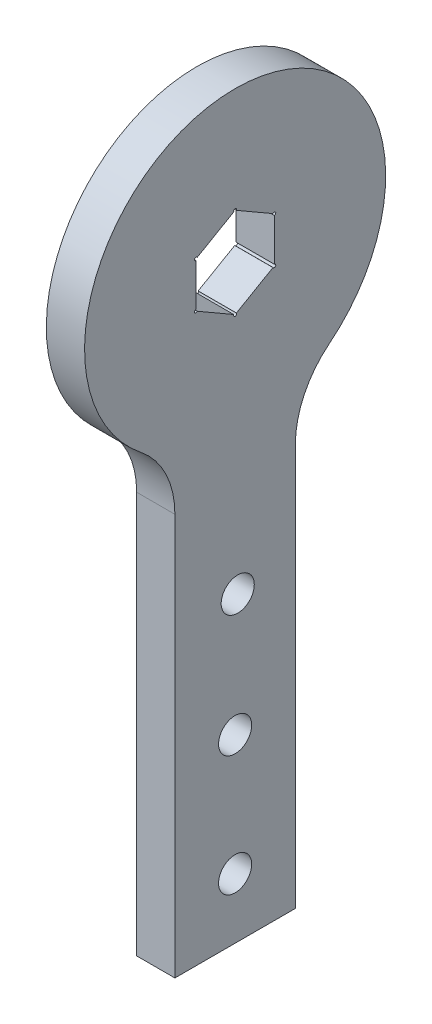
ISO-10303-21;
HEADER;
FILE_DESCRIPTION(('STEP AP214'),'2;1');
FILE_NAME('part.step','',(''),(''),'','','');
FILE_SCHEMA(('AUTOMOTIVE_DESIGN { 1 0 10303 214 1 1 1 1 }'));
ENDSEC;
DATA;
#1=APPLICATION_CONTEXT('core data for automotive mechanical design processes');
#2=APPLICATION_PROTOCOL_DEFINITION('international standard','automotive_design',2000,#1);
#3=PRODUCT_CONTEXT('',#1,'mechanical');
#4=PRODUCT('Part','Part','',(#3));
#5=PRODUCT_RELATED_PRODUCT_CATEGORY('part','',(#4));
#6=PRODUCT_DEFINITION_FORMATION('','',#4);
#7=PRODUCT_DEFINITION_CONTEXT('part definition',#1,'design');
#8=PRODUCT_DEFINITION('design','',#6,#7);
#9=PRODUCT_DEFINITION_SHAPE('','',#8);
#10=(LENGTH_UNIT() NAMED_UNIT(*) SI_UNIT(.MILLI.,.METRE.));
#11=(NAMED_UNIT(*) PLANE_ANGLE_UNIT() SI_UNIT($,.RADIAN.));
#12=(NAMED_UNIT(*) SI_UNIT($,.STERADIAN.) SOLID_ANGLE_UNIT());
#13=UNCERTAINTY_MEASURE_WITH_UNIT(LENGTH_MEASURE(1.E-05),#10,'distance_accuracy_value','');
#14=(GEOMETRIC_REPRESENTATION_CONTEXT(3) GLOBAL_UNCERTAINTY_ASSIGNED_CONTEXT((#13)) GLOBAL_UNIT_ASSIGNED_CONTEXT((#10,
#11,#12)) REPRESENTATION_CONTEXT('',''));
#15=CARTESIAN_POINT('',(0.,0.,0.));
#16=DIRECTION('',(0.,0.,1.));
#17=DIRECTION('',(1.,0.,0.));
#18=AXIS2_PLACEMENT_3D('',#15,#16,#17);
#19=CARTESIAN_POINT('',(6.35,-97.9128784747792,10.));
#20=DIRECTION('',(0.,1.,0.));
#21=DIRECTION('',(0.,0.,1.));
#22=AXIS2_PLACEMENT_3D('',#19,#20,#21);
#23=PLANE('',#22);
#24=DIRECTION('',(0.,0.,-1.));
#25=VECTOR('',#24,1.);
#26=CARTESIAN_POINT('',(0.,-97.9128784747792,10.));
#27=LINE('',#26,#25);
#28=CARTESIAN_POINT('',(0.,-97.9128784747792,10.));
#29=VERTEX_POINT('',#28);
#30=CARTESIAN_POINT('',(0.,-97.9128784747792,-10.));
#31=VERTEX_POINT('',#30);
#32=EDGE_CURVE('E205',#29,#31,#27,.T.);
#33=ORIENTED_EDGE('',*,*,#32,.T.);
#34=DIRECTION('',(-1.,0.,0.));
#35=VECTOR('',#34,1.);
#36=CARTESIAN_POINT('',(6.35,-97.9128784747792,-10.));
#37=LINE('',#36,#35);
#38=CARTESIAN_POINT('',(6.35,-97.9128784747792,-10.));
#39=VERTEX_POINT('',#38);
#40=EDGE_CURVE('E244',#39,#31,#37,.T.);
#41=ORIENTED_EDGE('',*,*,#40,.F.);
#42=DIRECTION('',(0.,0.,-1.));
#43=VECTOR('',#42,1.);
#44=CARTESIAN_POINT('',(6.35,-97.9128784747792,10.));
#45=LINE('',#44,#43);
#46=CARTESIAN_POINT('',(6.35,-97.9128784747792,10.));
#47=VERTEX_POINT('',#46);
#48=EDGE_CURVE('E220',#47,#39,#45,.T.);
#49=ORIENTED_EDGE('',*,*,#48,.F.);
#50=DIRECTION('',(-1.,0.,0.));
#51=VECTOR('',#50,1.);
#52=CARTESIAN_POINT('',(6.35,-97.9128784747792,10.));
#53=LINE('',#52,#51);
#54=EDGE_CURVE('E232',#47,#29,#53,.T.);
#55=ORIENTED_EDGE('',*,*,#54,.T.);
#56=EDGE_LOOP('',(#33,#41,#49,#55));
#57=FACE_BOUND('',#56,.T.);
#58=ADVANCED_FACE('F40',(#57),#23,.F.);
#59=CARTESIAN_POINT('',(6.35,-97.9128784747792,-10.));
#60=DIRECTION('',(0.,0.,1.));
#61=DIRECTION('',(0.,-1.,0.));
#62=AXIS2_PLACEMENT_3D('',#59,#60,#61);
#63=PLANE('',#62);
#64=DIRECTION('',(0.,1.,0.));
#65=VECTOR('',#64,1.);
#66=CARTESIAN_POINT('',(0.,-97.9128784747792,-10.));
#67=LINE('',#66,#65);
#68=CARTESIAN_POINT('',(0.,-31.224989991992,-10.));
#69=VERTEX_POINT('',#68);
#70=EDGE_CURVE('E235',#31,#69,#67,.T.);
#71=ORIENTED_EDGE('',*,*,#70,.T.);
#72=DIRECTION('',(1.,0.,0.));
#73=VECTOR('',#72,1.);
#74=CARTESIAN_POINT('',(6.35,-31.224989991992,-10.));
#75=LINE('',#74,#73);
#76=CARTESIAN_POINT('',(6.35,-31.224989991992,-10.));
#77=VERTEX_POINT('',#76);
#78=EDGE_CURVE('E252',#69,#77,#75,.T.);
#79=ORIENTED_EDGE('',*,*,#78,.T.);
#80=DIRECTION('',(0.,1.,0.));
#81=VECTOR('',#80,1.);
#82=CARTESIAN_POINT('',(6.35,-97.9128784747792,-10.));
#83=LINE('',#82,#81);
#84=EDGE_CURVE('E223',#39,#77,#83,.T.);
#85=ORIENTED_EDGE('',*,*,#84,.F.);
#86=ORIENTED_EDGE('',*,*,#40,.T.);
#87=EDGE_LOOP('',(#71,#79,#85,#86));
#88=FACE_BOUND('',#87,.T.);
#89=ADVANCED_FACE('F286',(#88),#63,.F.);
#90=CARTESIAN_POINT('',(6.35,0.,0.));
#91=DIRECTION('',(-1.,0.,0.));
#92=DIRECTION('',(0.,0.,1.));
#93=AXIS2_PLACEMENT_3D('',#90,#91,#92);
#94=CYLINDRICAL_SURFACE('',#93,25.);
#95=CARTESIAN_POINT('',(6.35,0.,0.));
#96=DIRECTION('',(1.,0.,0.));
#97=DIRECTION('',(0.,0.,-1.));
#98=AXIS2_PLACEMENT_3D('',#95,#96,#97);
#99=CIRCLE('',#98,25.);
#100=CARTESIAN_POINT('',(6.35,-19.515618744995,-15.625));
#101=VERTEX_POINT('',#100);
#102=CARTESIAN_POINT('',(6.35,-19.515618744995,15.625));
#103=VERTEX_POINT('',#102);
#104=EDGE_CURVE('E227',#101,#103,#99,.T.);
#105=ORIENTED_EDGE('',*,*,#104,.F.);
#106=DIRECTION('',(-1.,0.,0.));
#107=VECTOR('',#106,1.);
#108=CARTESIAN_POINT('',(6.35,-19.515618744995,-15.625));
#109=LINE('',#108,#107);
#110=CARTESIAN_POINT('',(0.,-19.515618744995,-15.625));
#111=VERTEX_POINT('',#110);
#112=EDGE_CURVE('E249',#101,#111,#109,.T.);
#113=ORIENTED_EDGE('',*,*,#112,.T.);
#114=CARTESIAN_POINT('',(0.,0.,0.));
#115=DIRECTION('',(1.,0.,0.));
#116=DIRECTION('',(0.,0.,-1.));
#117=AXIS2_PLACEMENT_3D('',#114,#115,#116);
#118=CIRCLE('',#117,25.);
#119=CARTESIAN_POINT('',(0.,-19.515618744995,15.625));
#120=VERTEX_POINT('',#119);
#121=EDGE_CURVE('E238',#111,#120,#118,.T.);
#122=ORIENTED_EDGE('',*,*,#121,.T.);
#123=DIRECTION('',(-1.,0.,0.));
#124=VECTOR('',#123,1.);
#125=CARTESIAN_POINT('',(6.35,-19.515618744995,15.625));
#126=LINE('',#125,#124);
#127=EDGE_CURVE('E247',#120,#103,#126,.F.);
#128=ORIENTED_EDGE('',*,*,#127,.T.);
#129=EDGE_LOOP('',(#105,#113,#122,#128));
#130=FACE_BOUND('',#129,.T.);
#131=ADVANCED_FACE('F270',(#130),#94,.T.);
#132=CARTESIAN_POINT('',(6.35,-22.9128784747792,10.));
#133=DIRECTION('',(0.,0.,-1.));
#134=DIRECTION('',(0.,1.,0.));
#135=AXIS2_PLACEMENT_3D('',#132,#133,#134);
#136=PLANE('',#135);
#137=DIRECTION('',(0.,-1.,0.));
#138=VECTOR('',#137,1.);
#139=CARTESIAN_POINT('',(6.35,-22.9128784747792,10.));
#140=LINE('',#139,#138);
#141=CARTESIAN_POINT('',(6.35,-31.224989991992,10.));
#142=VERTEX_POINT('',#141);
#143=EDGE_CURVE('E230',#142,#47,#140,.T.);
#144=ORIENTED_EDGE('',*,*,#143,.F.);
#145=DIRECTION('',(1.,0.,0.));
#146=VECTOR('',#145,1.);
#147=CARTESIAN_POINT('',(0.,-31.224989991992,10.));
#148=LINE('',#147,#146);
#149=CARTESIAN_POINT('',(0.,-31.224989991992,10.));
#150=VERTEX_POINT('',#149);
#151=EDGE_CURVE('E254',#142,#150,#148,.F.);
#152=ORIENTED_EDGE('',*,*,#151,.T.);
#153=DIRECTION('',(0.,-1.,0.));
#154=VECTOR('',#153,1.);
#155=CARTESIAN_POINT('',(0.,-22.9128784747792,10.));
#156=LINE('',#155,#154);
#157=EDGE_CURVE('E224',#150,#29,#156,.T.);
#158=ORIENTED_EDGE('',*,*,#157,.T.);
#159=ORIENTED_EDGE('',*,*,#54,.F.);
#160=EDGE_LOOP('',(#144,#152,#158,#159));
#161=FACE_BOUND('',#160,.T.);
#162=ADVANCED_FACE('F277',(#161),#136,.F.);
#163=CARTESIAN_POINT('',(6.35,0.,0.));
#164=DIRECTION('',(1.,0.,0.));
#165=DIRECTION('',(0.,0.,-1.));
#166=AXIS2_PLACEMENT_3D('',#163,#164,#165);
#167=PLANE('',#166);
#168=CARTESIAN_POINT('',(6.35,7.50555349946514,0.));
#169=DIRECTION('',(1.,0.,0.));
#170=DIRECTION('',(0.,0.,-1.));
#171=AXIS2_PLACEMENT_3D('',#168,#169,#170);
#172=CIRCLE('',#171,0.25);
#173=CARTESIAN_POINT('',(6.35,7.38055349946514,-0.21650635094611));
#174=VERTEX_POINT('',#173);
#175=CARTESIAN_POINT('',(6.35,7.38055349946514,0.21650635094611));
#176=VERTEX_POINT('',#175);
#177=EDGE_CURVE('E163',#174,#176,#172,.T.);
#178=ORIENTED_EDGE('',*,*,#177,.F.);
#179=DIRECTION('',(0.,0.5,0.866025403784439));
#180=VECTOR('',#179,1.);
#181=CARTESIAN_POINT('',(6.35,3.75277674973257,-6.5));
#182=LINE('',#181,#180);
#183=CARTESIAN_POINT('',(6.35,3.87777674973256,-6.28349364905391));
#184=VERTEX_POINT('',#183);
#185=EDGE_CURVE('E190',#184,#174,#182,.T.);
#186=ORIENTED_EDGE('',*,*,#185,.F.);
#187=CARTESIAN_POINT('',(6.35,3.75277674973255,-6.50000000000001));
#188=DIRECTION('',(1.,0.,0.));
#189=DIRECTION('',(0.,0.,-1.));
#190=AXIS2_PLACEMENT_3D('',#187,#188,#189);
#191=CIRCLE('',#190,0.25);
#192=CARTESIAN_POINT('',(6.35,3.50277674973255,-6.5));
#193=VERTEX_POINT('',#192);
#194=EDGE_CURVE('E525',#193,#184,#191,.T.);
#195=ORIENTED_EDGE('',*,*,#194,.F.);
#196=DIRECTION('',(0.,1.,0.));
#197=VECTOR('',#196,1.);
#198=CARTESIAN_POINT('',(6.35,-3.75277674973257,-6.5));
#199=LINE('',#198,#197);
#200=CARTESIAN_POINT('',(6.35,-3.5027767497326,-6.5));
#201=VERTEX_POINT('',#200);
#202=EDGE_CURVE('E195',#201,#193,#199,.T.);
#203=ORIENTED_EDGE('',*,*,#202,.F.);
#204=CARTESIAN_POINT('',(6.35,-3.7527767497326,-6.49999999999998));
#205=DIRECTION('',(1.,0.,0.));
#206=DIRECTION('',(0.,0.,-1.));
#207=AXIS2_PLACEMENT_3D('',#204,#205,#206);
#208=CIRCLE('',#207,0.25);
#209=CARTESIAN_POINT('',(6.35,-3.87777674973258,-6.28349364905386));
#210=VERTEX_POINT('',#209);
#211=EDGE_CURVE('E524',#210,#201,#208,.T.);
#212=ORIENTED_EDGE('',*,*,#211,.F.);
#213=DIRECTION('',(0.,0.5,-0.866025403784438));
#214=VECTOR('',#213,1.);
#215=CARTESIAN_POINT('',(6.35,-7.50555349946514,0.));
#216=LINE('',#215,#214);
#217=CARTESIAN_POINT('',(6.35,-7.38055349946511,-0.216506350946143));
#218=VERTEX_POINT('',#217);
#219=EDGE_CURVE('E507',#218,#210,#216,.T.);
#220=ORIENTED_EDGE('',*,*,#219,.F.);
#221=CARTESIAN_POINT('',(6.35,-7.50555349946514,0.));
#222=DIRECTION('',(1.,0.,0.));
#223=DIRECTION('',(0.,0.,-1.));
#224=AXIS2_PLACEMENT_3D('',#221,#222,#223);
#225=CIRCLE('',#224,0.25);
#226=CARTESIAN_POINT('',(6.35,-7.38055349946511,0.216506350946149));
#227=VERTEX_POINT('',#226);
#228=EDGE_CURVE('E544',#227,#218,#225,.T.);
#229=ORIENTED_EDGE('',*,*,#228,.F.);
#230=DIRECTION('',(0.,-0.5,-0.866025403784438));
#231=VECTOR('',#230,1.);
#232=CARTESIAN_POINT('',(6.35,-3.75277674973257,6.5));
#233=LINE('',#232,#231);
#234=CARTESIAN_POINT('',(6.35,-3.87777674973254,6.28349364905394));
#235=VERTEX_POINT('',#234);
#236=EDGE_CURVE('E505',#235,#227,#233,.T.);
#237=ORIENTED_EDGE('',*,*,#236,.F.);
#238=CARTESIAN_POINT('',(6.35,-3.75277674973251,6.50000000000004));
#239=DIRECTION('',(1.,0.,0.));
#240=DIRECTION('',(0.,0.,-1.));
#241=AXIS2_PLACEMENT_3D('',#238,#239,#240);
#242=CIRCLE('',#241,0.25);
#243=CARTESIAN_POINT('',(6.35,-3.50277674973251,6.5));
#244=VERTEX_POINT('',#243);
#245=EDGE_CURVE('E487',#244,#235,#242,.T.);
#246=ORIENTED_EDGE('',*,*,#245,.F.);
#247=DIRECTION('',(0.,-1.,0.));
#248=VECTOR('',#247,1.);
#249=CARTESIAN_POINT('',(6.35,3.75277674973257,6.5));
#250=LINE('',#249,#248);
#251=CARTESIAN_POINT('',(6.35,3.50277674973264,6.5));
#252=VERTEX_POINT('',#251);
#253=EDGE_CURVE('E189',#252,#244,#250,.T.);
#254=ORIENTED_EDGE('',*,*,#253,.F.);
#255=CARTESIAN_POINT('',(6.35,3.75277674973264,6.49999999999996));
#256=DIRECTION('',(1.,0.,0.));
#257=DIRECTION('',(0.,0.,-1.));
#258=AXIS2_PLACEMENT_3D('',#255,#256,#257);
#259=CIRCLE('',#258,0.25);
#260=CARTESIAN_POINT('',(6.35,3.87777674973261,6.28349364905383));
#261=VERTEX_POINT('',#260);
#262=EDGE_CURVE('E188',#261,#252,#259,.T.);
#263=ORIENTED_EDGE('',*,*,#262,.F.);
#264=DIRECTION('',(0.,-0.5,0.866025403784439));
#265=VECTOR('',#264,1.);
#266=CARTESIAN_POINT('',(6.35,7.50555349946514,0.));
#267=LINE('',#266,#265);
#268=EDGE_CURVE('E180',#176,#261,#267,.T.);
#269=ORIENTED_EDGE('',*,*,#268,.F.);
#270=EDGE_LOOP('',(#178,#186,#195,#203,#212,#220,#229,#237,#246,#254,#263,#269));
#271=FACE_BOUND('',#270,.T.);
#272=CARTESIAN_POINT('',(6.35,-87.9128784747792,0.));
#273=DIRECTION('',(1.,0.,0.));
#274=DIRECTION('',(0.,0.,-1.));
#275=AXIS2_PLACEMENT_3D('',#272,#273,#274);
#276=CIRCLE('',#275,2.75);
#277=CARTESIAN_POINT('',(6.35,-87.9128784747792,-2.75));
#278=VERTEX_POINT('',#277);
#279=EDGE_CURVE('E206',#278,#278,#276,.T.);
#280=ORIENTED_EDGE('',*,*,#279,.F.);
#281=EDGE_LOOP('',(#280));
#282=FACE_BOUND('',#281,.T.);
#283=CARTESIAN_POINT('',(6.35,-67.9128784747792,0.));
#284=DIRECTION('',(1.,0.,0.));
#285=DIRECTION('',(0.,0.,-1.));
#286=AXIS2_PLACEMENT_3D('',#283,#284,#285);
#287=CIRCLE('',#286,2.75);
#288=CARTESIAN_POINT('',(6.35,-67.9128784747792,-2.75));
#289=VERTEX_POINT('',#288);
#290=EDGE_CURVE('E209',#289,#289,#287,.T.);
#291=ORIENTED_EDGE('',*,*,#290,.F.);
#292=EDGE_LOOP('',(#291));
#293=FACE_BOUND('',#292,.T.);
#294=CARTESIAN_POINT('',(6.35,-47.9128784747792,-0.431184647680993));
#295=DIRECTION('',(1.,0.,0.));
#296=DIRECTION('',(0.,0.,-1.));
#297=AXIS2_PLACEMENT_3D('',#294,#295,#296);
#298=CIRCLE('',#297,2.75);
#299=CARTESIAN_POINT('',(6.35,-47.9128784747792,-3.18118464768099));
#300=VERTEX_POINT('',#299);
#301=EDGE_CURVE('E215',#300,#300,#298,.T.);
#302=ORIENTED_EDGE('',*,*,#301,.F.);
#303=EDGE_LOOP('',(#302));
#304=FACE_BOUND('',#303,.T.);
#305=ORIENTED_EDGE('',*,*,#48,.T.);
#306=ORIENTED_EDGE('',*,*,#84,.T.);
#307=CARTESIAN_POINT('',(6.35,-31.224989991992,-25.));
#308=DIRECTION('',(1.,0.,0.));
#309=DIRECTION('',(0.,0.,-1.));
#310=AXIS2_PLACEMENT_3D('',#307,#308,#309);
#311=CIRCLE('',#310,15.);
#312=EDGE_CURVE('E259',#77,#101,#311,.F.);
#313=ORIENTED_EDGE('',*,*,#312,.T.);
#314=ORIENTED_EDGE('',*,*,#104,.T.);
#315=CARTESIAN_POINT('',(6.35,-31.224989991992,25.));
#316=DIRECTION('',(1.,0.,0.));
#317=DIRECTION('',(0.,0.,-1.));
#318=AXIS2_PLACEMENT_3D('',#315,#316,#317);
#319=CIRCLE('',#318,15.);
#320=EDGE_CURVE('E11',#103,#142,#319,.F.);
#321=ORIENTED_EDGE('',*,*,#320,.T.);
#322=ORIENTED_EDGE('',*,*,#143,.T.);
#323=EDGE_LOOP('',(#305,#306,#313,#314,#321,#322));
#324=FACE_BOUND('',#323,.T.);
#325=ADVANCED_FACE('F185',(#271,#282,#293,#304,#324),#167,.T.);
#326=CARTESIAN_POINT('',(0.,0.,0.));
#327=DIRECTION('',(1.,0.,0.));
#328=DIRECTION('',(0.,0.,-1.));
#329=AXIS2_PLACEMENT_3D('',#326,#327,#328);
#330=PLANE('',#329);
#331=DIRECTION('',(0.,-0.5,-0.866025403784439));
#332=VECTOR('',#331,1.);
#333=CARTESIAN_POINT('',(0.,3.75277674973257,-6.5));
#334=LINE('',#333,#332);
#335=CARTESIAN_POINT('',(0.,7.38055349946514,-0.216506350946111));
#336=VERTEX_POINT('',#335);
#337=CARTESIAN_POINT('',(0.,3.87777674973256,-6.28349364905391));
#338=VERTEX_POINT('',#337);
#339=EDGE_CURVE('E552',#336,#338,#334,.T.);
#340=ORIENTED_EDGE('',*,*,#339,.F.);
#341=CARTESIAN_POINT('',(0.,7.50555349946514,0.));
#342=DIRECTION('',(1.,0.,0.));
#343=DIRECTION('',(0.,0.,-1.));
#344=AXIS2_PLACEMENT_3D('',#341,#342,#343);
#345=CIRCLE('',#344,0.25);
#346=CARTESIAN_POINT('',(0.,7.38055349946514,0.21650635094611));
#347=VERTEX_POINT('',#346);
#348=EDGE_CURVE('E174',#347,#336,#345,.F.);
#349=ORIENTED_EDGE('',*,*,#348,.F.);
#350=DIRECTION('',(0.,0.5,-0.866025403784439));
#351=VECTOR('',#350,1.);
#352=CARTESIAN_POINT('',(0.,7.50555349946514,0.));
#353=LINE('',#352,#351);
#354=CARTESIAN_POINT('',(0.,3.87777674973261,6.28349364905383));
#355=VERTEX_POINT('',#354);
#356=EDGE_CURVE('E182',#355,#347,#353,.T.);
#357=ORIENTED_EDGE('',*,*,#356,.F.);
#358=CARTESIAN_POINT('',(0.,3.75277674973264,6.49999999999996));
#359=DIRECTION('',(1.,0.,0.));
#360=DIRECTION('',(0.,0.,-1.));
#361=AXIS2_PLACEMENT_3D('',#358,#359,#360);
#362=CIRCLE('',#361,0.25);
#363=CARTESIAN_POINT('',(0.,3.50277674973264,6.5));
#364=VERTEX_POINT('',#363);
#365=EDGE_CURVE('E63',#364,#355,#362,.F.);
#366=ORIENTED_EDGE('',*,*,#365,.F.);
#367=DIRECTION('',(0.,1.,0.));
#368=VECTOR('',#367,1.);
#369=CARTESIAN_POINT('',(0.,3.75277674973257,6.5));
#370=LINE('',#369,#368);
#371=CARTESIAN_POINT('',(0.,-3.50277674973251,6.5));
#372=VERTEX_POINT('',#371);
#373=EDGE_CURVE('E500',#372,#364,#370,.T.);
#374=ORIENTED_EDGE('',*,*,#373,.F.);
#375=CARTESIAN_POINT('',(0.,-3.75277674973251,6.50000000000004));
#376=DIRECTION('',(1.,0.,0.));
#377=DIRECTION('',(0.,0.,-1.));
#378=AXIS2_PLACEMENT_3D('',#375,#376,#377);
#379=CIRCLE('',#378,0.25);
#380=CARTESIAN_POINT('',(0.,-3.87777674973254,6.28349364905394));
#381=VERTEX_POINT('',#380);
#382=EDGE_CURVE('E55',#381,#372,#379,.F.);
#383=ORIENTED_EDGE('',*,*,#382,.F.);
#384=DIRECTION('',(0.,0.5,0.866025403784439));
#385=VECTOR('',#384,1.);
#386=CARTESIAN_POINT('',(0.,-3.75277674973257,6.5));
#387=LINE('',#386,#385);
#388=CARTESIAN_POINT('',(0.,-7.38055349946511,0.216506350946149));
#389=VERTEX_POINT('',#388);
#390=EDGE_CURVE('E498',#389,#381,#387,.T.);
#391=ORIENTED_EDGE('',*,*,#390,.F.);
#392=CARTESIAN_POINT('',(0.,-7.50555349946514,0.));
#393=DIRECTION('',(1.,0.,0.));
#394=DIRECTION('',(0.,0.,-1.));
#395=AXIS2_PLACEMENT_3D('',#392,#393,#394);
#396=CIRCLE('',#395,0.25);
#397=CARTESIAN_POINT('',(0.,-7.38055349946516,-0.216506350946069));
#398=VERTEX_POINT('',#397);
#399=EDGE_CURVE('E542',#398,#389,#396,.F.);
#400=ORIENTED_EDGE('',*,*,#399,.F.);
#401=DIRECTION('',(0.,-0.5,0.866025403784439));
#402=VECTOR('',#401,1.);
#403=CARTESIAN_POINT('',(0.,-7.50555349946514,0.));
#404=LINE('',#403,#402);
#405=CARTESIAN_POINT('',(0.,-3.87777674973258,-6.28349364905387));
#406=VERTEX_POINT('',#405);
#407=EDGE_CURVE('E193',#406,#398,#404,.T.);
#408=ORIENTED_EDGE('',*,*,#407,.F.);
#409=CARTESIAN_POINT('',(0.,-3.7527767497326,-6.49999999999998));
#410=DIRECTION('',(1.,0.,0.));
#411=DIRECTION('',(0.,0.,-1.));
#412=AXIS2_PLACEMENT_3D('',#409,#410,#411);
#413=CIRCLE('',#412,0.25);
#414=CARTESIAN_POINT('',(0.,-3.5027767497326,-6.5));
#415=VERTEX_POINT('',#414);
#416=EDGE_CURVE('E536',#415,#406,#413,.F.);
#417=ORIENTED_EDGE('',*,*,#416,.F.);
#418=DIRECTION('',(0.,-1.,0.));
#419=VECTOR('',#418,1.);
#420=CARTESIAN_POINT('',(0.,-3.75277674973257,-6.5));
#421=LINE('',#420,#419);
#422=CARTESIAN_POINT('',(0.,3.50277674973255,-6.5));
#423=VERTEX_POINT('',#422);
#424=EDGE_CURVE('E550',#423,#415,#421,.T.);
#425=ORIENTED_EDGE('',*,*,#424,.F.);
#426=CARTESIAN_POINT('',(0.,3.75277674973255,-6.50000000000001));
#427=DIRECTION('',(1.,0.,0.));
#428=DIRECTION('',(0.,0.,-1.));
#429=AXIS2_PLACEMENT_3D('',#426,#427,#428);
#430=CIRCLE('',#429,0.25);
#431=EDGE_CURVE('E528',#338,#423,#430,.F.);
#432=ORIENTED_EDGE('',*,*,#431,.F.);
#433=EDGE_LOOP('',(#340,#349,#357,#366,#374,#383,#391,#400,#408,#417,#425,#432));
#434=FACE_BOUND('',#433,.T.);
#435=CARTESIAN_POINT('',(0.,-87.9128784747792,0.));
#436=DIRECTION('',(1.,0.,0.));
#437=DIRECTION('',(0.,0.,-1.));
#438=AXIS2_PLACEMENT_3D('',#435,#436,#437);
#439=CIRCLE('',#438,2.75);
#440=CARTESIAN_POINT('',(0.,-87.9128784747792,-2.75));
#441=VERTEX_POINT('',#440);
#442=EDGE_CURVE('E202',#441,#441,#439,.T.);
#443=ORIENTED_EDGE('',*,*,#442,.T.);
#444=EDGE_LOOP('',(#443));
#445=FACE_BOUND('',#444,.T.);
#446=CARTESIAN_POINT('',(0.,-67.9128784747792,0.));
#447=DIRECTION('',(1.,0.,0.));
#448=DIRECTION('',(0.,0.,-1.));
#449=AXIS2_PLACEMENT_3D('',#446,#447,#448);
#450=CIRCLE('',#449,2.75);
#451=CARTESIAN_POINT('',(0.,-67.9128784747792,-2.75));
#452=VERTEX_POINT('',#451);
#453=EDGE_CURVE('E212',#452,#452,#450,.T.);
#454=ORIENTED_EDGE('',*,*,#453,.T.);
#455=EDGE_LOOP('',(#454));
#456=FACE_BOUND('',#455,.T.);
#457=CARTESIAN_POINT('',(0.,-47.9128784747792,-0.431184647680993));
#458=DIRECTION('',(1.,0.,0.));
#459=DIRECTION('',(0.,0.,-1.));
#460=AXIS2_PLACEMENT_3D('',#457,#458,#459);
#461=CIRCLE('',#460,2.75);
#462=CARTESIAN_POINT('',(0.,-47.9128784747792,-3.18118464768099));
#463=VERTEX_POINT('',#462);
#464=EDGE_CURVE('E201',#463,#463,#461,.T.);
#465=ORIENTED_EDGE('',*,*,#464,.T.);
#466=EDGE_LOOP('',(#465));
#467=FACE_BOUND('',#466,.T.);
#468=ORIENTED_EDGE('',*,*,#32,.F.);
#469=ORIENTED_EDGE('',*,*,#157,.F.);
#470=CARTESIAN_POINT('',(0.,-31.224989991992,25.));
#471=DIRECTION('',(1.,0.,0.));
#472=DIRECTION('',(0.,0.,-1.));
#473=AXIS2_PLACEMENT_3D('',#470,#471,#472);
#474=CIRCLE('',#473,15.);
#475=EDGE_CURVE('E48',#150,#120,#474,.T.);
#476=ORIENTED_EDGE('',*,*,#475,.T.);
#477=ORIENTED_EDGE('',*,*,#121,.F.);
#478=CARTESIAN_POINT('',(0.,-31.224989991992,-25.));
#479=DIRECTION('',(1.,0.,0.));
#480=DIRECTION('',(0.,0.,-1.));
#481=AXIS2_PLACEMENT_3D('',#478,#479,#480);
#482=CIRCLE('',#481,15.);
#483=EDGE_CURVE('E257',#111,#69,#482,.T.);
#484=ORIENTED_EDGE('',*,*,#483,.T.);
#485=ORIENTED_EDGE('',*,*,#70,.F.);
#486=EDGE_LOOP('',(#468,#469,#476,#477,#484,#485));
#487=FACE_BOUND('',#486,.T.);
#488=ADVANCED_FACE('F264',(#434,#445,#456,#467,#487),#330,.F.);
#489=CARTESIAN_POINT('',(0.,-47.9128784747792,-0.431184647680993));
#490=DIRECTION('',(1.,0.,0.));
#491=DIRECTION('',(0.,0.,-1.));
#492=AXIS2_PLACEMENT_3D('',#489,#490,#491);
#493=CYLINDRICAL_SURFACE('',#492,2.75);
#494=ORIENTED_EDGE('',*,*,#464,.F.);
#495=EDGE_LOOP('',(#494));
#496=FACE_BOUND('',#495,.T.);
#497=ORIENTED_EDGE('',*,*,#301,.T.);
#498=EDGE_LOOP('',(#497));
#499=FACE_BOUND('',#498,.T.);
#500=ADVANCED_FACE('F310',(#496,#499),#493,.F.);
#501=CARTESIAN_POINT('',(0.,-67.9128784747792,0.));
#502=DIRECTION('',(1.,0.,0.));
#503=DIRECTION('',(0.,0.,-1.));
#504=AXIS2_PLACEMENT_3D('',#501,#502,#503);
#505=CYLINDRICAL_SURFACE('',#504,2.75);
#506=ORIENTED_EDGE('',*,*,#453,.F.);
#507=EDGE_LOOP('',(#506));
#508=FACE_BOUND('',#507,.T.);
#509=ORIENTED_EDGE('',*,*,#290,.T.);
#510=EDGE_LOOP('',(#509));
#511=FACE_BOUND('',#510,.T.);
#512=ADVANCED_FACE('F304',(#508,#511),#505,.F.);
#513=CARTESIAN_POINT('',(0.,-87.9128784747792,0.));
#514=DIRECTION('',(1.,0.,0.));
#515=DIRECTION('',(0.,0.,-1.));
#516=AXIS2_PLACEMENT_3D('',#513,#514,#515);
#517=CYLINDRICAL_SURFACE('',#516,2.75);
#518=ORIENTED_EDGE('',*,*,#442,.F.);
#519=EDGE_LOOP('',(#518));
#520=FACE_BOUND('',#519,.T.);
#521=ORIENTED_EDGE('',*,*,#279,.T.);
#522=EDGE_LOOP('',(#521));
#523=FACE_BOUND('',#522,.T.);
#524=ADVANCED_FACE('F298',(#520,#523),#517,.F.);
#525=CARTESIAN_POINT('',(6.35,-31.224989991992,-25.));
#526=DIRECTION('',(-1.,0.,0.));
#527=DIRECTION('',(0.,0.,1.));
#528=AXIS2_PLACEMENT_3D('',#525,#526,#527);
#529=CYLINDRICAL_SURFACE('',#528,15.);
#530=ORIENTED_EDGE('',*,*,#312,.F.);
#531=ORIENTED_EDGE('',*,*,#78,.F.);
#532=ORIENTED_EDGE('',*,*,#483,.F.);
#533=ORIENTED_EDGE('',*,*,#112,.F.);
#534=EDGE_LOOP('',(#530,#531,#532,#533));
#535=FACE_BOUND('',#534,.T.);
#536=ADVANCED_FACE('F285',(#535),#529,.F.);
#537=CARTESIAN_POINT('',(6.35,-31.224989991992,25.));
#538=DIRECTION('',(-1.,0.,0.));
#539=DIRECTION('',(0.,0.,1.));
#540=AXIS2_PLACEMENT_3D('',#537,#538,#539);
#541=CYLINDRICAL_SURFACE('',#540,15.);
#542=ORIENTED_EDGE('',*,*,#320,.F.);
#543=ORIENTED_EDGE('',*,*,#127,.F.);
#544=ORIENTED_EDGE('',*,*,#475,.F.);
#545=ORIENTED_EDGE('',*,*,#151,.F.);
#546=EDGE_LOOP('',(#542,#543,#544,#545));
#547=FACE_BOUND('',#546,.T.);
#548=ADVANCED_FACE('F42',(#547),#541,.F.);
#549=CARTESIAN_POINT('',(-0.00100000000000013,-3.75277674973257,6.5));
#550=DIRECTION('',(0.,-0.866025403784438,0.5));
#551=DIRECTION('',(0.,-0.5,-0.866025403784439));
#552=AXIS2_PLACEMENT_3D('',#549,#550,#551);
#553=PLANE('',#552);
#554=ORIENTED_EDGE('',*,*,#390,.T.);
#555=DIRECTION('',(1.,0.,0.));
#556=VECTOR('',#555,1.);
#557=CARTESIAN_POINT('',(-0.00100000000000013,-3.87777674973254,6.28349364905394));
#558=LINE('',#557,#556);
#559=EDGE_CURVE('E485',#235,#381,#558,.F.);
#560=ORIENTED_EDGE('',*,*,#559,.F.);
#561=ORIENTED_EDGE('',*,*,#236,.T.);
#562=DIRECTION('',(1.,0.,0.));
#563=VECTOR('',#562,1.);
#564=CARTESIAN_POINT('',(-0.00100000000000013,-7.38055349946511,0.216506350946149));
#565=LINE('',#564,#563);
#566=EDGE_CURVE('E504',#389,#227,#565,.T.);
#567=ORIENTED_EDGE('',*,*,#566,.F.);
#568=EDGE_LOOP('',(#554,#560,#561,#567));
#569=FACE_BOUND('',#568,.T.);
#570=ADVANCED_FACE('F303',(#569),#553,.F.);
#571=CARTESIAN_POINT('',(-0.00100000000000013,3.75277674973257,6.5));
#572=DIRECTION('',(0.,0.,1.));
#573=DIRECTION('',(0.,-1.,0.));
#574=AXIS2_PLACEMENT_3D('',#571,#572,#573);
#575=PLANE('',#574);
#576=ORIENTED_EDGE('',*,*,#373,.T.);
#577=DIRECTION('',(1.,0.,0.));
#578=VECTOR('',#577,1.);
#579=CARTESIAN_POINT('',(-0.00100000000000013,3.50277674973264,6.5));
#580=LINE('',#579,#578);
#581=EDGE_CURVE('E561',#252,#364,#580,.F.);
#582=ORIENTED_EDGE('',*,*,#581,.F.);
#583=ORIENTED_EDGE('',*,*,#253,.T.);
#584=DIRECTION('',(1.,0.,0.));
#585=VECTOR('',#584,1.);
#586=CARTESIAN_POINT('',(-0.00100000000000013,-3.50277674973251,6.5));
#587=LINE('',#586,#585);
#588=EDGE_CURVE('E491',#372,#244,#587,.T.);
#589=ORIENTED_EDGE('',*,*,#588,.F.);
#590=EDGE_LOOP('',(#576,#582,#583,#589));
#591=FACE_BOUND('',#590,.T.);
#592=ADVANCED_FACE('F379',(#591),#575,.F.);
#593=CARTESIAN_POINT('',(-0.00100000000000013,7.50555349946514,0.));
#594=DIRECTION('',(0.,0.866025403784439,0.5));
#595=DIRECTION('',(0.,-0.5,0.866025403784439));
#596=AXIS2_PLACEMENT_3D('',#593,#594,#595);
#597=PLANE('',#596);
#598=ORIENTED_EDGE('',*,*,#356,.T.);
#599=DIRECTION('',(1.,0.,0.));
#600=VECTOR('',#599,1.);
#601=CARTESIAN_POINT('',(-0.00100000000000013,7.38055349946514,0.21650635094611));
#602=LINE('',#601,#600);
#603=EDGE_CURVE('E166',#176,#347,#602,.F.);
#604=ORIENTED_EDGE('',*,*,#603,.F.);
#605=ORIENTED_EDGE('',*,*,#268,.T.);
#606=DIRECTION('',(1.,0.,0.));
#607=VECTOR('',#606,1.);
#608=CARTESIAN_POINT('',(-0.00100000000000013,3.87777674973261,6.28349364905383));
#609=LINE('',#608,#607);
#610=EDGE_CURVE('E501',#355,#261,#609,.T.);
#611=ORIENTED_EDGE('',*,*,#610,.F.);
#612=EDGE_LOOP('',(#598,#604,#605,#611));
#613=FACE_BOUND('',#612,.T.);
#614=ADVANCED_FACE('F179',(#613),#597,.F.);
#615=CARTESIAN_POINT('',(-0.00100000000000013,3.75277674973257,-6.5));
#616=DIRECTION('',(0.,0.866025403784439,-0.5));
#617=DIRECTION('',(0.,0.5,0.866025403784439));
#618=AXIS2_PLACEMENT_3D('',#615,#616,#617);
#619=PLANE('',#618);
#620=ORIENTED_EDGE('',*,*,#185,.T.);
#621=DIRECTION('',(1.,0.,0.));
#622=VECTOR('',#621,1.);
#623=CARTESIAN_POINT('',(-0.00100000000000013,7.38055349946514,-0.21650635094611));
#624=LINE('',#623,#622);
#625=EDGE_CURVE('E169',#336,#174,#624,.T.);
#626=ORIENTED_EDGE('',*,*,#625,.F.);
#627=ORIENTED_EDGE('',*,*,#339,.T.);
#628=DIRECTION('',(1.,0.,0.));
#629=VECTOR('',#628,1.);
#630=CARTESIAN_POINT('',(-0.00100000000000013,3.87777674973256,-6.28349364905391));
#631=LINE('',#630,#629);
#632=EDGE_CURVE('E527',#184,#338,#631,.F.);
#633=ORIENTED_EDGE('',*,*,#632,.F.);
#634=EDGE_LOOP('',(#620,#626,#627,#633));
#635=FACE_BOUND('',#634,.T.);
#636=ADVANCED_FACE('F397',(#635),#619,.F.);
#637=CARTESIAN_POINT('',(-0.00100000000000013,-3.75277674973257,-6.5));
#638=DIRECTION('',(0.,0.,-1.));
#639=DIRECTION('',(-1.,0.,0.));
#640=AXIS2_PLACEMENT_3D('',#637,#638,#639);
#641=PLANE('',#640);
#642=ORIENTED_EDGE('',*,*,#424,.T.);
#643=DIRECTION('',(1.,0.,0.));
#644=VECTOR('',#643,1.);
#645=CARTESIAN_POINT('',(-0.00100000000000013,-3.5027767497326,-6.5));
#646=LINE('',#645,#644);
#647=EDGE_CURVE('E520',#201,#415,#646,.F.);
#648=ORIENTED_EDGE('',*,*,#647,.F.);
#649=ORIENTED_EDGE('',*,*,#202,.T.);
#650=DIRECTION('',(1.,0.,0.));
#651=VECTOR('',#650,1.);
#652=CARTESIAN_POINT('',(-0.00100000000000013,3.50277674973255,-6.5));
#653=LINE('',#652,#651);
#654=EDGE_CURVE('E518',#423,#193,#653,.T.);
#655=ORIENTED_EDGE('',*,*,#654,.F.);
#656=EDGE_LOOP('',(#642,#648,#649,#655));
#657=FACE_BOUND('',#656,.T.);
#658=ADVANCED_FACE('F406',(#657),#641,.F.);
#659=CARTESIAN_POINT('',(-0.00100000000000013,-7.50555349946514,0.));
#660=DIRECTION('',(0.,-0.866025403784438,-0.5));
#661=DIRECTION('',(0.,0.5,-0.866025403784439));
#662=AXIS2_PLACEMENT_3D('',#659,#660,#661);
#663=PLANE('',#662);
#664=ORIENTED_EDGE('',*,*,#407,.T.);
#665=DIRECTION('',(1.,0.,0.));
#666=VECTOR('',#665,1.);
#667=CARTESIAN_POINT('',(-0.00100000000000013,-7.38055349946516,-0.216506350946069));
#668=LINE('',#667,#666);
#669=EDGE_CURVE('E538',#218,#398,#668,.F.);
#670=ORIENTED_EDGE('',*,*,#669,.F.);
#671=ORIENTED_EDGE('',*,*,#219,.T.);
#672=DIRECTION('',(1.,0.,0.));
#673=VECTOR('',#672,1.);
#674=CARTESIAN_POINT('',(-0.00100000000000013,-3.87777674973258,-6.28349364905386));
#675=LINE('',#674,#673);
#676=EDGE_CURVE('E531',#406,#210,#675,.T.);
#677=ORIENTED_EDGE('',*,*,#676,.F.);
#678=EDGE_LOOP('',(#664,#670,#671,#677));
#679=FACE_BOUND('',#678,.T.);
#680=ADVANCED_FACE('F416',(#679),#663,.F.);
#681=CARTESIAN_POINT('',(-0.00100000000000013,-3.7527767497326,-6.49999999999998));
#682=DIRECTION('',(1.,0.,0.));
#683=DIRECTION('',(0.,0.,-1.));
#684=AXIS2_PLACEMENT_3D('',#681,#682,#683);
#685=CYLINDRICAL_SURFACE('',#684,0.25);
#686=ORIENTED_EDGE('',*,*,#647,.T.);
#687=ORIENTED_EDGE('',*,*,#416,.T.);
#688=ORIENTED_EDGE('',*,*,#676,.T.);
#689=ORIENTED_EDGE('',*,*,#211,.T.);
#690=EDGE_LOOP('',(#686,#687,#688,#689));
#691=FACE_BOUND('',#690,.T.);
#692=ADVANCED_FACE('F426',(#691),#685,.F.);
#693=CARTESIAN_POINT('',(-0.00100000000000013,-7.50555349946514,0.));
#694=DIRECTION('',(1.,0.,0.));
#695=DIRECTION('',(0.,0.,-1.));
#696=AXIS2_PLACEMENT_3D('',#693,#694,#695);
#697=CYLINDRICAL_SURFACE('',#696,0.25);
#698=ORIENTED_EDGE('',*,*,#566,.T.);
#699=ORIENTED_EDGE('',*,*,#228,.T.);
#700=ORIENTED_EDGE('',*,*,#669,.T.);
#701=ORIENTED_EDGE('',*,*,#399,.T.);
#702=EDGE_LOOP('',(#698,#699,#700,#701));
#703=FACE_BOUND('',#702,.T.);
#704=ADVANCED_FACE('F435',(#703),#697,.F.);
#705=CARTESIAN_POINT('',(-0.00100000000000013,3.75277674973255,-6.50000000000001));
#706=DIRECTION('',(1.,0.,0.));
#707=DIRECTION('',(0.,0.,-1.));
#708=AXIS2_PLACEMENT_3D('',#705,#706,#707);
#709=CYLINDRICAL_SURFACE('',#708,0.25);
#710=ORIENTED_EDGE('',*,*,#632,.T.);
#711=ORIENTED_EDGE('',*,*,#431,.T.);
#712=ORIENTED_EDGE('',*,*,#654,.T.);
#713=ORIENTED_EDGE('',*,*,#194,.T.);
#714=EDGE_LOOP('',(#710,#711,#712,#713));
#715=FACE_BOUND('',#714,.T.);
#716=ADVANCED_FACE('F445',(#715),#709,.F.);
#717=CARTESIAN_POINT('',(-0.00100000000000013,7.50555349946514,0.));
#718=DIRECTION('',(1.,0.,0.));
#719=DIRECTION('',(0.,0.,-1.));
#720=AXIS2_PLACEMENT_3D('',#717,#718,#719);
#721=CYLINDRICAL_SURFACE('',#720,0.25);
#722=ORIENTED_EDGE('',*,*,#603,.T.);
#723=ORIENTED_EDGE('',*,*,#348,.T.);
#724=ORIENTED_EDGE('',*,*,#625,.T.);
#725=ORIENTED_EDGE('',*,*,#177,.T.);
#726=EDGE_LOOP('',(#722,#723,#724,#725));
#727=FACE_BOUND('',#726,.T.);
#728=ADVANCED_FACE('F165',(#727),#721,.F.);
#729=CARTESIAN_POINT('',(-0.00100000000000013,3.75277674973264,6.49999999999996));
#730=DIRECTION('',(1.,0.,0.));
#731=DIRECTION('',(0.,0.,-1.));
#732=AXIS2_PLACEMENT_3D('',#729,#730,#731);
#733=CYLINDRICAL_SURFACE('',#732,0.25);
#734=ORIENTED_EDGE('',*,*,#581,.T.);
#735=ORIENTED_EDGE('',*,*,#365,.T.);
#736=ORIENTED_EDGE('',*,*,#610,.T.);
#737=ORIENTED_EDGE('',*,*,#262,.T.);
#738=EDGE_LOOP('',(#734,#735,#736,#737));
#739=FACE_BOUND('',#738,.T.);
#740=ADVANCED_FACE('F464',(#739),#733,.F.);
#741=CARTESIAN_POINT('',(-0.00100000000000013,-3.75277674973251,6.50000000000004));
#742=DIRECTION('',(1.,0.,0.));
#743=DIRECTION('',(0.,0.,-1.));
#744=AXIS2_PLACEMENT_3D('',#741,#742,#743);
#745=CYLINDRICAL_SURFACE('',#744,0.25);
#746=ORIENTED_EDGE('',*,*,#559,.T.);
#747=ORIENTED_EDGE('',*,*,#382,.T.);
#748=ORIENTED_EDGE('',*,*,#588,.T.);
#749=ORIENTED_EDGE('',*,*,#245,.T.);
#750=EDGE_LOOP('',(#746,#747,#748,#749));
#751=FACE_BOUND('',#750,.T.);
#752=ADVANCED_FACE('F473',(#751),#745,.F.);
#753=CLOSED_SHELL('',(#58,#89,#131,#162,#325,#488,#500,#512,#524,#536,#548,#570,#592,#614,#636,
#658,#680,#692,#704,#716,#728,#740,#752));
#754=MANIFOLD_SOLID_BREP('B2',#753);
#755=ADVANCED_BREP_SHAPE_REPRESENTATION('',(#18,#754),#14);
#756=SHAPE_DEFINITION_REPRESENTATION(#9,#755);
ENDSEC;
END-ISO-10303-21;
